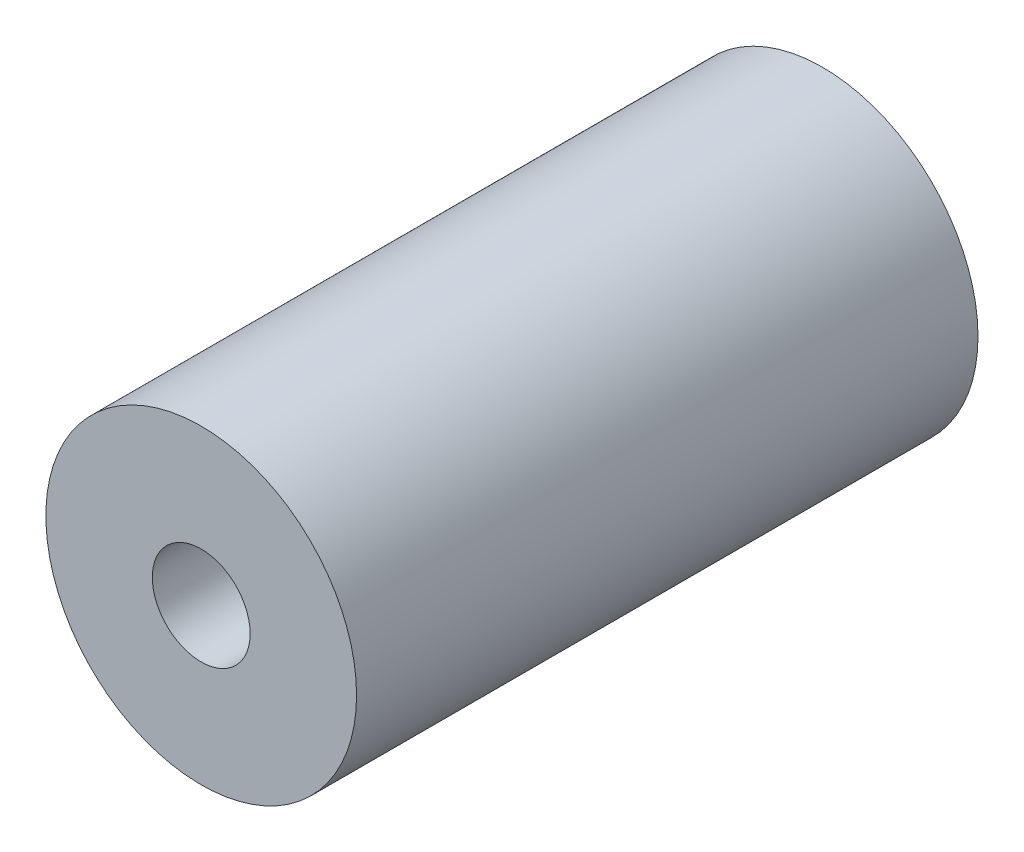
ISO-10303-21;
HEADER;
FILE_DESCRIPTION(('STEP AP214'),'2;1');
FILE_NAME('part.step','',(''),(''),'','','');
FILE_SCHEMA(('AUTOMOTIVE_DESIGN { 1 0 10303 214 1 1 1 1 }'));
ENDSEC;
DATA;
#1=APPLICATION_CONTEXT('core data for automotive mechanical design processes');
#2=APPLICATION_PROTOCOL_DEFINITION('international standard','automotive_design',2000,#1);
#3=PRODUCT_CONTEXT('',#1,'mechanical');
#4=PRODUCT('Part','Part','',(#3));
#5=PRODUCT_RELATED_PRODUCT_CATEGORY('part','',(#4));
#6=PRODUCT_DEFINITION_FORMATION('','',#4);
#7=PRODUCT_DEFINITION_CONTEXT('part definition',#1,'design');
#8=PRODUCT_DEFINITION('design','',#6,#7);
#9=PRODUCT_DEFINITION_SHAPE('','',#8);
#10=(LENGTH_UNIT() NAMED_UNIT(*) SI_UNIT(.MILLI.,.METRE.));
#11=(NAMED_UNIT(*) PLANE_ANGLE_UNIT() SI_UNIT($,.RADIAN.));
#12=(NAMED_UNIT(*) SI_UNIT($,.STERADIAN.) SOLID_ANGLE_UNIT());
#13=UNCERTAINTY_MEASURE_WITH_UNIT(LENGTH_MEASURE(1.E-05),#10,'distance_accuracy_value','');
#14=(GEOMETRIC_REPRESENTATION_CONTEXT(3) GLOBAL_UNCERTAINTY_ASSIGNED_CONTEXT((#13)) GLOBAL_UNIT_ASSIGNED_CONTEXT((#10,
#11,#12)) REPRESENTATION_CONTEXT('',''));
#15=CARTESIAN_POINT('',(0.,0.,0.));
#16=DIRECTION('',(0.,0.,1.));
#17=DIRECTION('',(1.,0.,0.));
#18=AXIS2_PLACEMENT_3D('',#15,#16,#17);
#19=CARTESIAN_POINT('',(0.,0.,25.4));
#20=DIRECTION('',(0.,0.,1.));
#21=DIRECTION('',(1.,0.,0.));
#22=AXIS2_PLACEMENT_3D('',#19,#20,#21);
#23=PLANE('',#22);
#24=CARTESIAN_POINT('',(0.,0.,25.4));
#25=DIRECTION('',(0.,0.,1.));
#26=DIRECTION('',(1.,0.,0.));
#27=AXIS2_PLACEMENT_3D('',#24,#25,#26);
#28=CIRCLE('',#27,6.35);
#29=CARTESIAN_POINT('',(6.35,0.,25.4));
#30=VERTEX_POINT('',#29);
#31=EDGE_CURVE('E10',#30,#30,#28,.T.);
#32=ORIENTED_EDGE('',*,*,#31,.T.);
#33=EDGE_LOOP('',(#32));
#34=FACE_BOUND('',#33,.T.);
#35=CARTESIAN_POINT('',(0.,0.,25.4));
#36=DIRECTION('',(0.,0.,1.));
#37=DIRECTION('',(1.,0.,0.));
#38=AXIS2_PLACEMENT_3D('',#35,#36,#37);
#39=CIRCLE('',#38,2.);
#40=CARTESIAN_POINT('',(2.,0.,25.4));
#41=VERTEX_POINT('',#40);
#42=EDGE_CURVE('E54',#41,#41,#39,.T.);
#43=ORIENTED_EDGE('',*,*,#42,.F.);
#44=EDGE_LOOP('',(#43));
#45=FACE_BOUND('',#44,.T.);
#46=ADVANCED_FACE('F41',(#34,#45),#23,.T.);
#47=CARTESIAN_POINT('',(0.,0.,0.));
#48=DIRECTION('',(0.,0.,1.));
#49=DIRECTION('',(1.,0.,0.));
#50=AXIS2_PLACEMENT_3D('',#47,#48,#49);
#51=PLANE('',#50);
#52=CARTESIAN_POINT('',(0.,0.,0.));
#53=DIRECTION('',(0.,0.,1.));
#54=DIRECTION('',(1.,0.,0.));
#55=AXIS2_PLACEMENT_3D('',#52,#53,#54);
#56=CIRCLE('',#55,6.35);
#57=CARTESIAN_POINT('',(6.35,0.,0.));
#58=VERTEX_POINT('',#57);
#59=EDGE_CURVE('E45',#58,#58,#56,.T.);
#60=ORIENTED_EDGE('',*,*,#59,.F.);
#61=EDGE_LOOP('',(#60));
#62=FACE_BOUND('',#61,.T.);
#63=CARTESIAN_POINT('',(0.,0.,0.));
#64=DIRECTION('',(0.,0.,1.));
#65=DIRECTION('',(1.,0.,0.));
#66=AXIS2_PLACEMENT_3D('',#63,#64,#65);
#67=CIRCLE('',#66,2.);
#68=CARTESIAN_POINT('',(2.,0.,0.));
#69=VERTEX_POINT('',#68);
#70=EDGE_CURVE('E56',#69,#69,#67,.T.);
#71=ORIENTED_EDGE('',*,*,#70,.T.);
#72=EDGE_LOOP('',(#71));
#73=FACE_BOUND('',#72,.T.);
#74=ADVANCED_FACE('F68',(#62,#73),#51,.F.);
#75=CARTESIAN_POINT('',(0.,0.,25.4));
#76=DIRECTION('',(0.,0.,-1.));
#77=DIRECTION('',(-1.,0.,0.));
#78=AXIS2_PLACEMENT_3D('',#75,#76,#77);
#79=CYLINDRICAL_SURFACE('',#78,6.35);
#80=ORIENTED_EDGE('',*,*,#31,.F.);
#81=EDGE_LOOP('',(#80));
#82=FACE_BOUND('',#81,.T.);
#83=ORIENTED_EDGE('',*,*,#59,.T.);
#84=EDGE_LOOP('',(#83));
#85=FACE_BOUND('',#84,.T.);
#86=ADVANCED_FACE('F43',(#82,#85),#79,.T.);
#87=CARTESIAN_POINT('',(0.,0.,25.4));
#88=DIRECTION('',(0.,0.,-1.));
#89=DIRECTION('',(-1.,0.,0.));
#90=AXIS2_PLACEMENT_3D('',#87,#88,#89);
#91=CYLINDRICAL_SURFACE('',#90,2.);
#92=ORIENTED_EDGE('',*,*,#42,.T.);
#93=EDGE_LOOP('',(#92));
#94=FACE_BOUND('',#93,.T.);
#95=ORIENTED_EDGE('',*,*,#70,.F.);
#96=EDGE_LOOP('',(#95));
#97=FACE_BOUND('',#96,.T.);
#98=ADVANCED_FACE('F64',(#94,#97),#91,.F.);
#99=CLOSED_SHELL('',(#46,#74,#86,#98));
#100=MANIFOLD_SOLID_BREP('B2',#99);
#101=ADVANCED_BREP_SHAPE_REPRESENTATION('',(#18,#100),#14);
#102=SHAPE_DEFINITION_REPRESENTATION(#9,#101);
ENDSEC;
END-ISO-10303-21;
